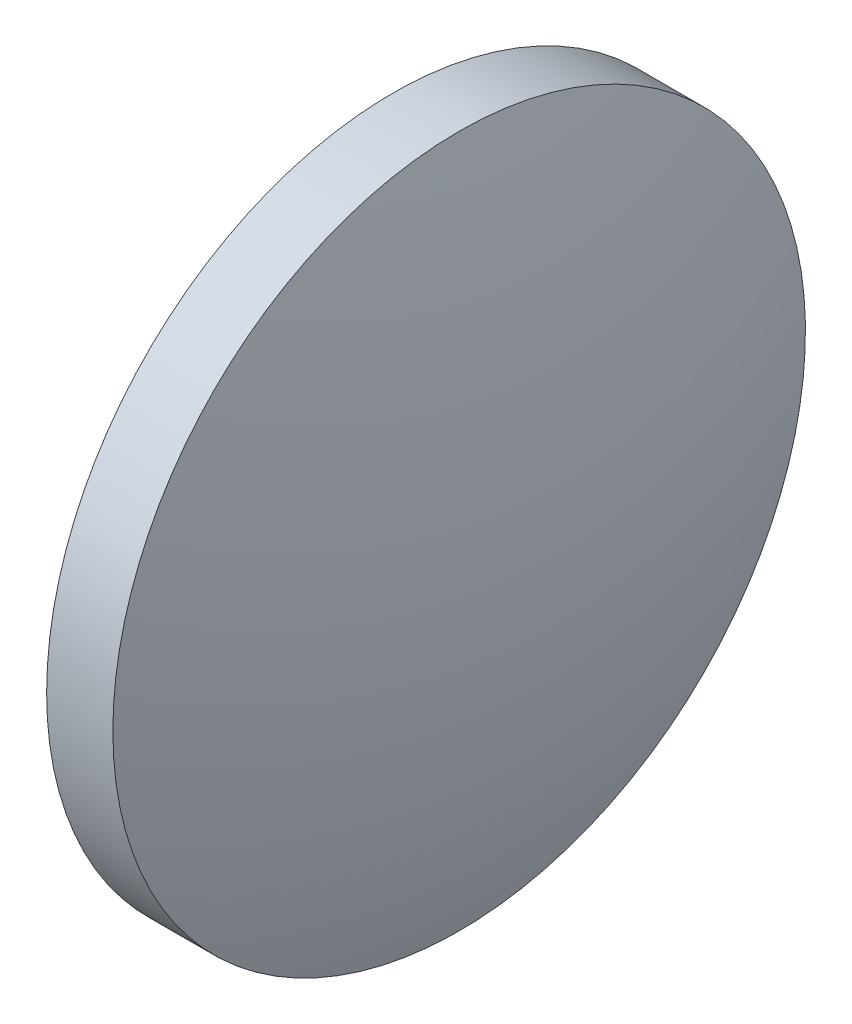
ISO-10303-21;
HEADER;
FILE_DESCRIPTION(('STEP AP214'),'2;1');
FILE_NAME('part.step','',(''),(''),'','','');
FILE_SCHEMA(('AUTOMOTIVE_DESIGN { 1 0 10303 214 1 1 1 1 }'));
ENDSEC;
DATA;
#1=APPLICATION_CONTEXT('core data for automotive mechanical design processes');
#2=APPLICATION_PROTOCOL_DEFINITION('international standard','automotive_design',2000,#1);
#3=PRODUCT_CONTEXT('',#1,'mechanical');
#4=PRODUCT('Part','Part','',(#3));
#5=PRODUCT_RELATED_PRODUCT_CATEGORY('part','',(#4));
#6=PRODUCT_DEFINITION_FORMATION('','',#4);
#7=PRODUCT_DEFINITION_CONTEXT('part definition',#1,'design');
#8=PRODUCT_DEFINITION('design','',#6,#7);
#9=PRODUCT_DEFINITION_SHAPE('','',#8);
#10=(LENGTH_UNIT() NAMED_UNIT(*) SI_UNIT(.MILLI.,.METRE.));
#11=(NAMED_UNIT(*) PLANE_ANGLE_UNIT() SI_UNIT($,.RADIAN.));
#12=(NAMED_UNIT(*) SI_UNIT($,.STERADIAN.) SOLID_ANGLE_UNIT());
#13=UNCERTAINTY_MEASURE_WITH_UNIT(LENGTH_MEASURE(1.E-05),#10,'distance_accuracy_value','');
#14=(GEOMETRIC_REPRESENTATION_CONTEXT(3) GLOBAL_UNCERTAINTY_ASSIGNED_CONTEXT((#13)) GLOBAL_UNIT_ASSIGNED_CONTEXT((#10,
#11,#12)) REPRESENTATION_CONTEXT('',''));
#15=CARTESIAN_POINT('',(0.,0.,0.));
#16=DIRECTION('',(0.,0.,1.));
#17=DIRECTION('',(1.,0.,0.));
#18=AXIS2_PLACEMENT_3D('',#15,#16,#17);
#19=CARTESIAN_POINT('',(660.031700463436,205.99017943151,0.));
#20=DIRECTION('',(-1.,0.,0.));
#21=DIRECTION('',(0.,1.,0.));
#22=AXIS2_PLACEMENT_3D('',#19,#20,#21);
#23=SPHERICAL_SURFACE('',#22,25.8318503937008);
#24=CARTESIAN_POINT('',(684.593550857137,205.99017943151,0.));
#25=DIRECTION('',(-1.,0.,0.));
#26=DIRECTION('',(0.,0.,1.));
#27=AXIS2_PLACEMENT_3D('',#24,#25,#26);
#28=CIRCLE('',#27,7.99999999999998);
#29=CARTESIAN_POINT('',(684.593550857137,205.99017943151,7.99999999999998));
#30=VERTEX_POINT('',#29);
#31=EDGE_CURVE('E10',#30,#30,#28,.T.);
#32=ORIENTED_EDGE('',*,*,#31,.F.);
#33=EDGE_LOOP('',(#32));
#34=FACE_BOUND('',#33,.T.);
#35=ADVANCED_FACE('F35',(#34),#23,.T.);
#36=CARTESIAN_POINT('',(679.338282236775,205.99017943151,0.));
#37=DIRECTION('',(-1.,0.,0.));
#38=DIRECTION('',(0.,0.,1.));
#39=AXIS2_PLACEMENT_3D('',#36,#37,#38);
#40=CYLINDRICAL_SURFACE('',#39,7.99999999999998);
#41=CARTESIAN_POINT('',(683.063550857137,205.99017943151,0.));
#42=DIRECTION('',(-1.,0.,0.));
#43=DIRECTION('',(0.,0.,1.));
#44=AXIS2_PLACEMENT_3D('',#41,#42,#43);
#45=CIRCLE('',#44,7.99999999999998);
#46=CARTESIAN_POINT('',(683.063550857137,205.99017943151,7.99999999999998));
#47=VERTEX_POINT('',#46);
#48=EDGE_CURVE('E41',#47,#47,#45,.T.);
#49=ORIENTED_EDGE('',*,*,#48,.F.);
#50=EDGE_LOOP('',(#49));
#51=FACE_BOUND('',#50,.T.);
#52=ORIENTED_EDGE('',*,*,#31,.T.);
#53=EDGE_LOOP('',(#52));
#54=FACE_BOUND('',#53,.T.);
#55=ADVANCED_FACE('F49',(#51,#54),#40,.T.);
#56=CARTESIAN_POINT('',(683.063550857137,205.99017943151,0.));
#57=DIRECTION('',(1.,0.,0.));
#58=DIRECTION('',(0.,0.,-1.));
#59=AXIS2_PLACEMENT_3D('',#56,#57,#58);
#60=PLANE('',#59);
#61=ORIENTED_EDGE('',*,*,#48,.T.);
#62=EDGE_LOOP('',(#61));
#63=FACE_BOUND('',#62,.T.);
#64=ADVANCED_FACE('F47',(#63),#60,.F.);
#65=CLOSED_SHELL('',(#35,#55,#64));
#66=MANIFOLD_SOLID_BREP('B2',#65);
#67=ADVANCED_BREP_SHAPE_REPRESENTATION('',(#18,#66),#14);
#68=SHAPE_DEFINITION_REPRESENTATION(#9,#67);
ENDSEC;
END-ISO-10303-21;
